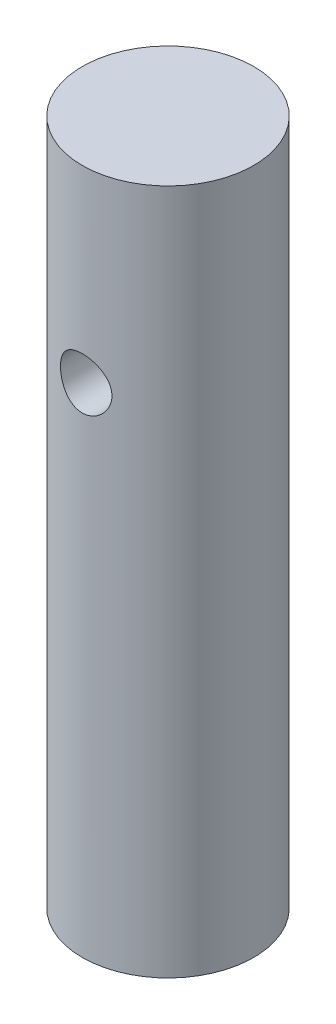
ISO-10303-21;
HEADER;
FILE_DESCRIPTION(('STEP AP214'),'2;1');
FILE_NAME('part.step','',(''),(''),'','','');
FILE_SCHEMA(('AUTOMOTIVE_DESIGN { 1 0 10303 214 1 1 1 1 }'));
ENDSEC;
DATA;
#1=APPLICATION_CONTEXT('core data for automotive mechanical design processes');
#2=APPLICATION_PROTOCOL_DEFINITION('international standard','automotive_design',2000,#1);
#3=PRODUCT_CONTEXT('',#1,'mechanical');
#4=PRODUCT('Part','Part','',(#3));
#5=PRODUCT_RELATED_PRODUCT_CATEGORY('part','',(#4));
#6=PRODUCT_DEFINITION_FORMATION('','',#4);
#7=PRODUCT_DEFINITION_CONTEXT('part definition',#1,'design');
#8=PRODUCT_DEFINITION('design','',#6,#7);
#9=PRODUCT_DEFINITION_SHAPE('','',#8);
#10=(LENGTH_UNIT() NAMED_UNIT(*) SI_UNIT(.MILLI.,.METRE.));
#11=(NAMED_UNIT(*) PLANE_ANGLE_UNIT() SI_UNIT($,.RADIAN.));
#12=(NAMED_UNIT(*) SI_UNIT($,.STERADIAN.) SOLID_ANGLE_UNIT());
#13=UNCERTAINTY_MEASURE_WITH_UNIT(LENGTH_MEASURE(1.E-05),#10,'distance_accuracy_value','');
#14=(GEOMETRIC_REPRESENTATION_CONTEXT(3) GLOBAL_UNCERTAINTY_ASSIGNED_CONTEXT((#13)) GLOBAL_UNIT_ASSIGNED_CONTEXT((#10,
#11,#12)) REPRESENTATION_CONTEXT('',''));
#15=CARTESIAN_POINT('',(0.,0.,0.));
#16=DIRECTION('',(0.,0.,1.));
#17=DIRECTION('',(1.,0.,0.));
#18=AXIS2_PLACEMENT_3D('',#15,#16,#17);
#19=CARTESIAN_POINT('',(0.,20.,0.));
#20=DIRECTION('',(0.,-1.,0.));
#21=DIRECTION('',(0.,0.,-1.));
#22=AXIS2_PLACEMENT_3D('',#19,#20,#21);
#23=CYLINDRICAL_SURFACE('',#22,2.5);
#24=CARTESIAN_POINT('',(0.750000000000001,14.5,-2.38484800354236));
#25=CARTESIAN_POINT('',(0.749999488170991,14.4589027260413,-2.38484842882332));
#26=CARTESIAN_POINT('',(0.746610540845051,14.4178003879651,-2.38592195177072));
#27=CARTESIAN_POINT('',(0.733179222242705,14.3367973752383,-2.39008289224361));
#28=CARTESIAN_POINT('',(0.72313462786923,14.2968971067561,-2.39317098266287));
#29=CARTESIAN_POINT('',(0.696763766346655,14.2194826358521,-2.40098051223348));
#30=CARTESIAN_POINT('',(0.68044794697038,14.1819645851802,-2.40569923346394));
#31=CARTESIAN_POINT('',(0.642032109590483,14.1101890330056,-2.41623466279006));
#32=CARTESIAN_POINT('',(0.619931225685491,14.0759320206587,-2.42205153521928));
#33=CARTESIAN_POINT('',(0.5698237707079,14.0105668047104,-2.43433431091424));
#34=CARTESIAN_POINT('',(0.54166603587897,13.9795770510266,-2.44081404155427));
#35=CARTESIAN_POINT('',(0.480568118789862,13.922681024339,-2.4535743096877));
#36=CARTESIAN_POINT('',(0.447627322730572,13.8967754047751,-2.45985482148958));
#37=CARTESIAN_POINT('',(0.377055718896827,13.8502686500833,-2.47166607289586));
#38=CARTESIAN_POINT('',(0.339342010667902,13.8297882877786,-2.47717862171173));
#39=CARTESIAN_POINT('',(0.260812322684681,13.7955063704786,-2.48667217960371));
#40=CARTESIAN_POINT('',(0.219997014193957,13.7817033750713,-2.49065351894755));
#41=CARTESIAN_POINT('',(0.137661926315413,13.7615599994547,-2.49653823001787));
#42=CARTESIAN_POINT('',(0.0961956994768995,13.7550174361736,-2.49849778684667));
#43=CARTESIAN_POINT('',(0.0127109118746571,13.7489413376768,-2.50031600750676));
#44=CARTESIAN_POINT('',(-0.0293075310251848,13.749406330299,-2.5001751126054));
#45=CARTESIAN_POINT('',(-0.111285578300081,13.7571964342715,-2.49784801908829));
#46=CARTESIAN_POINT('',(-0.151268133820672,13.7643025969049,-2.49572710102632));
#47=CARTESIAN_POINT('',(-0.229444606721264,13.7848156679971,-2.48975761056295));
#48=CARTESIAN_POINT('',(-0.267638410661424,13.7982229754713,-2.48590892875287));
#49=CARTESIAN_POINT('',(-0.341673663175641,13.8311060117093,-2.47682610493488));
#50=CARTESIAN_POINT('',(-0.37748253234724,13.8506506014036,-2.47157634838376));
#51=CARTESIAN_POINT('',(-0.445382336891578,13.8951989262141,-2.46024820324011));
#52=CARTESIAN_POINT('',(-0.477472387436065,13.9202039564817,-2.45416961818801));
#53=CARTESIAN_POINT('',(-0.538330240764901,13.9760988753758,-2.44155775244174));
#54=CARTESIAN_POINT('',(-0.566922290200562,14.0071784595149,-2.43501597661077));
#55=CARTESIAN_POINT('',(-0.618538257699114,14.073755008945,-2.42241989943402));
#56=CARTESIAN_POINT('',(-0.641561622414246,14.1092524126945,-2.41636564657216));
#57=CARTESIAN_POINT('',(-0.681569976677269,14.1841197346246,-2.40538951600145));
#58=CARTESIAN_POINT('',(-0.698494946188463,14.2235235229319,-2.40047905352876));
#59=CARTESIAN_POINT('',(-0.725416814392003,14.3048036042223,-2.39248196269322));
#60=CARTESIAN_POINT('',(-0.73541597320256,14.3466790857655,-2.38939473939638));
#61=CARTESIAN_POINT('',(-0.747873851410238,14.4300411803659,-2.38552424788241));
#62=CARTESIAN_POINT('',(-0.750599731901181,14.4714841119421,-2.38465939399775));
#63=CARTESIAN_POINT('',(-0.749179736165386,14.5542364500029,-2.38510596285214));
#64=CARTESIAN_POINT('',(-0.745034821855963,14.5955458743674,-2.38641708095323));
#65=CARTESIAN_POINT('',(-0.730228817870647,14.6757441889888,-2.390987792609));
#66=CARTESIAN_POINT('',(-0.71973980715632,14.7146680821327,-2.39419588249304));
#67=CARTESIAN_POINT('',(-0.692742888739782,14.7902008454066,-2.40214570620055));
#68=CARTESIAN_POINT('',(-0.67623405171382,14.82680935707,-2.40688767680741));
#69=CARTESIAN_POINT('',(-0.637159355982479,14.8977587320363,-2.41752917510286));
#70=CARTESIAN_POINT('',(-0.614442820863638,14.932012360493,-2.42345635534567));
#71=CARTESIAN_POINT('',(-0.563776508001929,14.9963190530903,-2.43574102823826));
#72=CARTESIAN_POINT('',(-0.535825477674485,15.0263711088064,-2.44209862365092));
#73=CARTESIAN_POINT('',(-0.474227566246797,15.0825902029074,-2.45481816773985));
#74=CARTESIAN_POINT('',(-0.440405532928716,15.1085678144935,-2.46117122531477));
#75=CARTESIAN_POINT('',(-0.368730892295123,15.1544833505139,-2.4729242587435));
#76=CARTESIAN_POINT('',(-0.330878485271971,15.1744215748907,-2.47832428192365));
#77=CARTESIAN_POINT('',(-0.252467752352609,15.2075000152842,-2.48752985237472));
#78=CARTESIAN_POINT('',(-0.211932311018918,15.2206910080795,-2.49134726712481));
#79=CARTESIAN_POINT('',(-0.129084983252293,15.2400304594452,-2.49700989798415));
#80=CARTESIAN_POINT('',(-0.0867736086773801,15.2461809329742,-2.4988556783544));
#81=CARTESIAN_POINT('',(-0.00332607694137024,15.2511115220273,-2.50033272040699));
#82=CARTESIAN_POINT('',(0.0377925895431043,15.2501663477039,-2.50004652555661));
#83=CARTESIAN_POINT('',(0.119259740582203,15.2415891837504,-2.49748632232518));
#84=CARTESIAN_POINT('',(0.159608268673265,15.2339575732598,-2.49521242665231));
#85=CARTESIAN_POINT('',(0.23796790652068,15.2123941693002,-2.48895584179164));
#86=CARTESIAN_POINT('',(0.275999463675697,15.1985309096755,-2.48499176450435));
#87=CARTESIAN_POINT('',(0.349216618876027,15.1649590427464,-2.47576471519723));
#88=CARTESIAN_POINT('',(0.38440174802529,15.1452494748569,-2.47050152974966));
#89=CARTESIAN_POINT('',(0.452150946210283,15.099813271285,-2.45901982914121));
#90=CARTESIAN_POINT('',(0.484595125038387,15.0739142849996,-2.45277613461807));
#91=CARTESIAN_POINT('',(0.54476878567297,15.0171448058336,-2.44011768606139));
#92=CARTESIAN_POINT('',(0.572496904800957,14.9862728810509,-2.43370288320437));
#93=CARTESIAN_POINT('',(0.623281346972757,14.9193296108448,-2.42120340315766));
#94=CARTESIAN_POINT('',(0.646173798789829,14.8831307233049,-2.41513426347144));
#95=CARTESIAN_POINT('',(0.685521567643833,14.8072224129193,-2.40426273753995));
#96=CARTESIAN_POINT('',(0.701979977786272,14.7675146881989,-2.39945974296979));
#97=CARTESIAN_POINT('',(0.726509712664903,14.6901297841973,-2.39213908360134));
#98=CARTESIAN_POINT('',(0.735294295056705,14.6526956765361,-2.38943077424999));
#99=CARTESIAN_POINT('',(0.747039094175175,14.5768423887505,-2.38578521293845));
#100=CARTESIAN_POINT('',(0.750000478528448,14.5384234076713,-2.38484760593099));
#101=CARTESIAN_POINT('',(0.750000000000001,14.5,-2.38484800354236));
#102=B_SPLINE_CURVE_WITH_KNOTS('',3,(#24,#25,#26,#27,#28,#29,#30,#31,#32,#33,#34,#35,#36,#37,
#38,#39,#40,#41,#42,#43,#44,#45,#46,#47,#48,#49,#50,#51,#52,#53,#54,#55,#56,#57,#58,#59,#60,#61,
#62,#63,#64,#65,#66,#67,#68,#69,#70,#71,#72,#73,#74,#75,#76,#77,#78,#79,#80,#81,#82,#83,#84,#85,
#86,#87,#88,#89,#90,#91,#92,#93,#94,#95,#96,#97,#98,#99,#100,#101),.UNSPECIFIED.,.T.,.F.,(4,2,2,
2,2,2,2,2,2,2,2,2,2,2,2,2,2,2,2,2,2,2,2,2,2,2,2,2,2,2,2,2,2,2,2,2,2,2,4),(0.,0.123150082939937,
0.246341320809978,0.369328207198575,0.492333512650529,0.618865750005398,0.745414239321843,
0.874579696333701,1.00371727790486,1.12916070071327,1.25457777047268,1.37600062991988,
1.49743117941736,1.62027604664386,1.74315008291963,1.87076073508187,1.99838406242479,
2.12723119119681,2.25603625310754,2.38004040390038,2.50402719546923,2.62479297462638,
2.74557740516123,2.86960365897924,2.99365962957691,3.12239753043531,3.25112903655331,
3.37887695900392,3.50658831154071,3.6293815194884,3.75216776517107,3.87363548429339,
3.99512317238919,4.12049813520474,4.24590926308175,4.37505819827803,4.50414496975202,
4.61930576921953,4.7344434751001),.UNSPECIFIED.);
#103=CARTESIAN_POINT('',(0.750000000000001,14.5,-2.38484800354236));
#104=VERTEX_POINT('',#103);
#105=EDGE_CURVE('E50',#104,#104,#102,.T.);
#106=ORIENTED_EDGE('',*,*,#105,.F.);
#107=EDGE_LOOP('',(#106));
#108=FACE_BOUND('',#107,.T.);
#109=CARTESIAN_POINT('',(-0.750000000000001,14.5,2.38484800354236));
#110=CARTESIAN_POINT('',(-0.749999488170991,14.5410972739587,2.38484842882332));
#111=CARTESIAN_POINT('',(-0.746610540845051,14.5821996120349,2.38592195177072));
#112=CARTESIAN_POINT('',(-0.733179222242705,14.6632026247617,2.3900828922436));
#113=CARTESIAN_POINT('',(-0.723134627869231,14.7031028932439,2.39317098266287));
#114=CARTESIAN_POINT('',(-0.696763766346655,14.7805173641479,2.40098051223348));
#115=CARTESIAN_POINT('',(-0.68044794697038,14.8180354148198,2.40569923346394));
#116=CARTESIAN_POINT('',(-0.642032109590483,14.8898109669944,2.41623466279006));
#117=CARTESIAN_POINT('',(-0.619931225685491,14.9240679793413,2.42205153521928));
#118=CARTESIAN_POINT('',(-0.5698237707079,14.9894331952896,2.43433431091424));
#119=CARTESIAN_POINT('',(-0.54166603587897,15.0204229489734,2.44081404155427));
#120=CARTESIAN_POINT('',(-0.480568118789862,15.077318975661,2.4535743096877));
#121=CARTESIAN_POINT('',(-0.447627322730572,15.1032245952249,2.45985482148958));
#122=CARTESIAN_POINT('',(-0.377055718896827,15.1497313499167,2.47166607289586));
#123=CARTESIAN_POINT('',(-0.339342010667902,15.1702117122214,2.47717862171173));
#124=CARTESIAN_POINT('',(-0.260812322684681,15.2044936295214,2.48667217960371));
#125=CARTESIAN_POINT('',(-0.219997014193957,15.2182966249287,2.49065351894755));
#126=CARTESIAN_POINT('',(-0.137661926315413,15.2384400005453,2.49653823001787));
#127=CARTESIAN_POINT('',(-0.0961956994768996,15.2449825638264,2.49849778684667));
#128=CARTESIAN_POINT('',(-0.0127109118746571,15.2510586623232,2.50031600750676));
#129=CARTESIAN_POINT('',(0.0293075310251847,15.250593669701,2.5001751126054));
#130=CARTESIAN_POINT('',(0.111285578300081,15.2428035657285,2.49784801908829));
#131=CARTESIAN_POINT('',(0.151268133820672,15.2356974030951,2.49572710102632));
#132=CARTESIAN_POINT('',(0.229444606721264,15.2151843320029,2.48975761056295));
#133=CARTESIAN_POINT('',(0.267638410661424,15.2017770245287,2.48590892875287));
#134=CARTESIAN_POINT('',(0.341673663175642,15.1688939882907,2.47682610493488));
#135=CARTESIAN_POINT('',(0.377482532347241,15.1493493985964,2.47157634838376));
#136=CARTESIAN_POINT('',(0.445382336891579,15.1048010737859,2.46024820324011));
#137=CARTESIAN_POINT('',(0.477472387436065,15.0797960435183,2.45416961818801));
#138=CARTESIAN_POINT('',(0.538330240764901,15.0239011246242,2.44155775244174));
#139=CARTESIAN_POINT('',(0.566922290200562,14.9928215404851,2.43501597661077));
#140=CARTESIAN_POINT('',(0.618538257699114,14.926244991055,2.42241989943402));
#141=CARTESIAN_POINT('',(0.641561622414246,14.8907475873055,2.41636564657216));
#142=CARTESIAN_POINT('',(0.681569976677269,14.8158802653754,2.40538951600145));
#143=CARTESIAN_POINT('',(0.698494946188463,14.7764764770681,2.40047905352876));
#144=CARTESIAN_POINT('',(0.725416814392003,14.6951963957777,2.39248196269322));
#145=CARTESIAN_POINT('',(0.73541597320256,14.6533209142345,2.38939473939638));
#146=CARTESIAN_POINT('',(0.747873851410238,14.5699588196342,2.38552424788241));
#147=CARTESIAN_POINT('',(0.750599731901181,14.5285158880579,2.38465939399775));
#148=CARTESIAN_POINT('',(0.749179736165386,14.4457635499971,2.38510596285214));
#149=CARTESIAN_POINT('',(0.745034821855963,14.4044541256326,2.38641708095323));
#150=CARTESIAN_POINT('',(0.730228817870647,14.3242558110112,2.390987792609));
#151=CARTESIAN_POINT('',(0.71973980715632,14.2853319178673,2.39419588249304));
#152=CARTESIAN_POINT('',(0.692742888739782,14.2097991545934,2.40214570620055));
#153=CARTESIAN_POINT('',(0.67623405171382,14.17319064293,2.40688767680741));
#154=CARTESIAN_POINT('',(0.637159355982479,14.1022412679637,2.41752917510286));
#155=CARTESIAN_POINT('',(0.614442820863638,14.067987639507,2.42345635534567));
#156=CARTESIAN_POINT('',(0.563776508001929,14.0036809469097,2.43574102823826));
#157=CARTESIAN_POINT('',(0.535825477674484,13.9736288911936,2.44209862365092));
#158=CARTESIAN_POINT('',(0.474227566246798,13.9174097970926,2.45481816773985));
#159=CARTESIAN_POINT('',(0.440405532928717,13.8914321855065,2.46117122531477));
#160=CARTESIAN_POINT('',(0.368730892295124,13.8455166494861,2.4729242587435));
#161=CARTESIAN_POINT('',(0.330878485271971,13.8255784251093,2.47832428192365));
#162=CARTESIAN_POINT('',(0.252467752352609,13.7924999847159,2.48752985237472));
#163=CARTESIAN_POINT('',(0.211932311018918,13.7793089919205,2.49134726712481));
#164=CARTESIAN_POINT('',(0.129084983252293,13.7599695405548,2.49700989798415));
#165=CARTESIAN_POINT('',(0.0867736086773801,13.7538190670258,2.4988556783544));
#166=CARTESIAN_POINT('',(0.00332607694137024,13.7488884779728,2.50033272040699));
#167=CARTESIAN_POINT('',(-0.0377925895431043,13.7498336522961,2.50004652555661));
#168=CARTESIAN_POINT('',(-0.119259740582203,13.7584108162496,2.49748632232518));
#169=CARTESIAN_POINT('',(-0.159608268673265,13.7660424267402,2.49521242665231));
#170=CARTESIAN_POINT('',(-0.23796790652068,13.7876058306998,2.48895584179164));
#171=CARTESIAN_POINT('',(-0.275999463675697,13.8014690903245,2.48499176450435));
#172=CARTESIAN_POINT('',(-0.349216618876027,13.8350409572536,2.47576471519723));
#173=CARTESIAN_POINT('',(-0.38440174802529,13.8547505251431,2.47050152974966));
#174=CARTESIAN_POINT('',(-0.452150946210284,13.900186728715,2.45901982914121));
#175=CARTESIAN_POINT('',(-0.484595125038388,13.9260857150004,2.45277613461807));
#176=CARTESIAN_POINT('',(-0.54476878567297,13.9828551941664,2.44011768606139));
#177=CARTESIAN_POINT('',(-0.572496904800957,14.0137271189491,2.43370288320437));
#178=CARTESIAN_POINT('',(-0.623281346972757,14.0806703891552,2.42120340315766));
#179=CARTESIAN_POINT('',(-0.646173798789829,14.1168692766951,2.41513426347144));
#180=CARTESIAN_POINT('',(-0.685521567643833,14.1927775870807,2.40426273753995));
#181=CARTESIAN_POINT('',(-0.701979977786272,14.2324853118011,2.39945974296979));
#182=CARTESIAN_POINT('',(-0.726509712664903,14.3098702158027,2.39213908360134));
#183=CARTESIAN_POINT('',(-0.735294295056705,14.3473043234639,2.38943077424999));
#184=CARTESIAN_POINT('',(-0.747039094175175,14.4231576112495,2.38578521293845));
#185=CARTESIAN_POINT('',(-0.750000478528448,14.4615765923287,2.38484760593099));
#186=CARTESIAN_POINT('',(-0.750000000000001,14.5,2.38484800354236));
#187=B_SPLINE_CURVE_WITH_KNOTS('',3,(#109,#110,#111,#112,#113,#114,#115,#116,#117,#118,#119,
#120,#121,#122,#123,#124,#125,#126,#127,#128,#129,#130,#131,#132,#133,#134,#135,#136,#137,#138,
#139,#140,#141,#142,#143,#144,#145,#146,#147,#148,#149,#150,#151,#152,#153,#154,#155,#156,#157,
#158,#159,#160,#161,#162,#163,#164,#165,#166,#167,#168,#169,#170,#171,#172,#173,#174,#175,#176,
#177,#178,#179,#180,#181,#182,#183,#184,#185,#186),.UNSPECIFIED.,.T.,.F.,(4,2,2,2,2,2,2,2,2,2,2,
2,2,2,2,2,2,2,2,2,2,2,2,2,2,2,2,2,2,2,2,2,2,2,2,2,2,2,4),(0.,0.123150082939935,
0.246341320809978,0.369328207198575,0.492333512650529,0.618865750005398,0.745414239321843,
0.874579696333701,1.00371727790486,1.12916070071327,1.25457777047268,1.37600062991988,
1.49743117941736,1.62027604664386,1.74315008291963,1.87076073508187,1.99838406242479,
2.12723119119681,2.25603625310754,2.38004040390038,2.50402719546923,2.62479297462638,
2.74557740516123,2.86960365897924,2.99365962957691,3.12239753043531,3.25112903655331,
3.37887695900392,3.50658831154071,3.6293815194884,3.75216776517107,3.87363548429339,
3.99512317238919,4.12049813520474,4.24590926308175,4.37505819827803,4.50414496975202,
4.61930576921953,4.7344434751001),.UNSPECIFIED.);
#188=CARTESIAN_POINT('',(-0.750000000000001,14.5,2.38484800354236));
#189=VERTEX_POINT('',#188);
#190=EDGE_CURVE('E59',#189,#189,#187,.T.);
#191=ORIENTED_EDGE('',*,*,#190,.T.);
#192=EDGE_LOOP('',(#191));
#193=FACE_BOUND('',#192,.T.);
#194=CARTESIAN_POINT('',(0.,20.,0.));
#195=DIRECTION('',(0.,1.,0.));
#196=DIRECTION('',(0.,0.,1.));
#197=AXIS2_PLACEMENT_3D('',#194,#195,#196);
#198=CIRCLE('',#197,2.5);
#199=CARTESIAN_POINT('',(0.,20.,2.5));
#200=VERTEX_POINT('',#199);
#201=EDGE_CURVE('E10',#200,#200,#198,.T.);
#202=ORIENTED_EDGE('',*,*,#201,.F.);
#203=EDGE_LOOP('',(#202));
#204=FACE_BOUND('',#203,.T.);
#205=CARTESIAN_POINT('',(0.,0.,0.));
#206=DIRECTION('',(0.,1.,0.));
#207=DIRECTION('',(0.,0.,1.));
#208=AXIS2_PLACEMENT_3D('',#205,#206,#207);
#209=CIRCLE('',#208,2.5);
#210=CARTESIAN_POINT('',(0.,0.,2.5));
#211=VERTEX_POINT('',#210);
#212=EDGE_CURVE('E43',#211,#211,#209,.T.);
#213=ORIENTED_EDGE('',*,*,#212,.T.);
#214=EDGE_LOOP('',(#213));
#215=FACE_BOUND('',#214,.T.);
#216=ADVANCED_FACE('F40',(#108,#193,#204,#215),#23,.T.);
#217=CARTESIAN_POINT('',(0.,20.,0.));
#218=DIRECTION('',(0.,1.,0.));
#219=DIRECTION('',(0.,0.,1.));
#220=AXIS2_PLACEMENT_3D('',#217,#218,#219);
#221=PLANE('',#220);
#222=ORIENTED_EDGE('',*,*,#201,.T.);
#223=EDGE_LOOP('',(#222));
#224=FACE_BOUND('',#223,.T.);
#225=ADVANCED_FACE('F69',(#224),#221,.T.);
#226=CARTESIAN_POINT('',(0.,0.,0.));
#227=DIRECTION('',(0.,1.,0.));
#228=DIRECTION('',(0.,0.,1.));
#229=AXIS2_PLACEMENT_3D('',#226,#227,#228);
#230=PLANE('',#229);
#231=ORIENTED_EDGE('',*,*,#212,.F.);
#232=EDGE_LOOP('',(#231));
#233=FACE_BOUND('',#232,.T.);
#234=ADVANCED_FACE('F71',(#233),#230,.F.);
#235=CARTESIAN_POINT('',(0.,14.5,-2.501));
#236=DIRECTION('',(0.,0.,1.));
#237=DIRECTION('',(1.,0.,0.));
#238=AXIS2_PLACEMENT_3D('',#235,#236,#237);
#239=CYLINDRICAL_SURFACE('',#238,0.750000000000001);
#240=ORIENTED_EDGE('',*,*,#105,.T.);
#241=EDGE_LOOP('',(#240));
#242=FACE_BOUND('',#241,.T.);
#243=ORIENTED_EDGE('',*,*,#190,.F.);
#244=EDGE_LOOP('',(#243));
#245=FACE_BOUND('',#244,.T.);
#246=ADVANCED_FACE('F65',(#242,#245),#239,.F.);
#247=CLOSED_SHELL('',(#216,#225,#234,#246));
#248=MANIFOLD_SOLID_BREP('B2',#247);
#249=ADVANCED_BREP_SHAPE_REPRESENTATION('',(#18,#248),#14);
#250=SHAPE_DEFINITION_REPRESENTATION(#9,#249);
ENDSEC;
END-ISO-10303-21;
